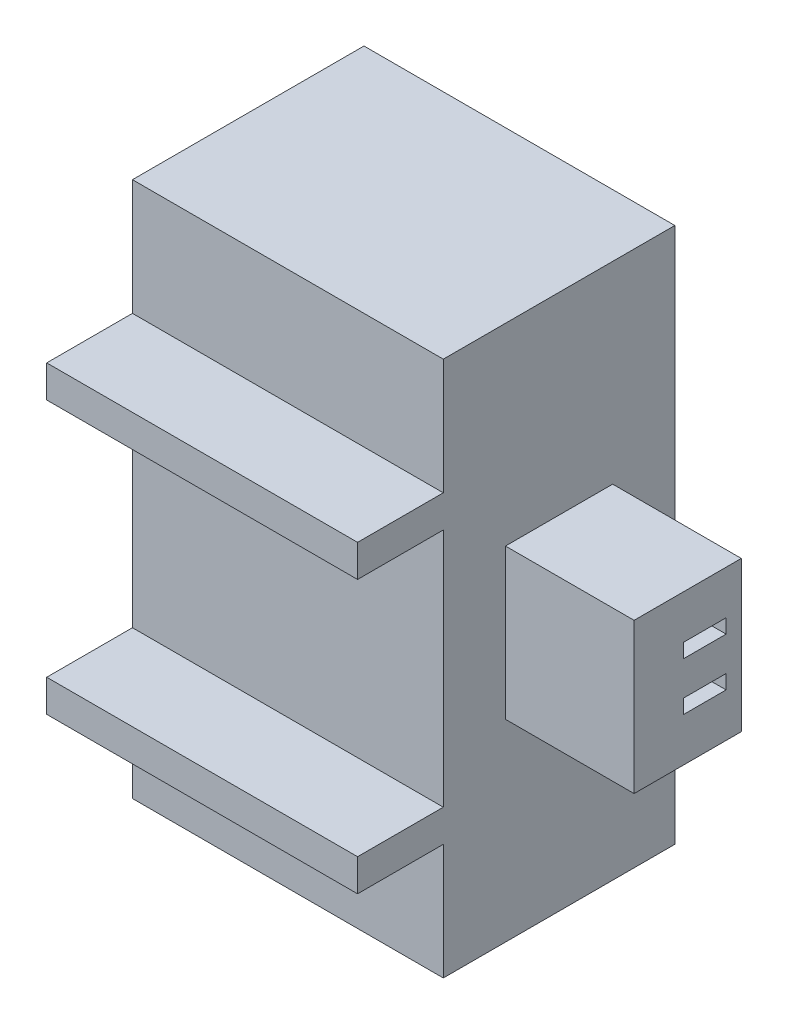
ISO-10303-21;
HEADER;
FILE_DESCRIPTION(('STEP AP214'),'2;1');
FILE_NAME('part.step','',(''),(''),'','','');
FILE_SCHEMA(('AUTOMOTIVE_DESIGN { 1 0 10303 214 1 1 1 1 }'));
ENDSEC;
DATA;
#1=APPLICATION_CONTEXT('core data for automotive mechanical design processes');
#2=APPLICATION_PROTOCOL_DEFINITION('international standard','automotive_design',2000,#1);
#3=PRODUCT_CONTEXT('',#1,'mechanical');
#4=PRODUCT('Part','Part','',(#3));
#5=PRODUCT_RELATED_PRODUCT_CATEGORY('part','',(#4));
#6=PRODUCT_DEFINITION_FORMATION('','',#4);
#7=PRODUCT_DEFINITION_CONTEXT('part definition',#1,'design');
#8=PRODUCT_DEFINITION('design','',#6,#7);
#9=PRODUCT_DEFINITION_SHAPE('','',#8);
#10=(LENGTH_UNIT() NAMED_UNIT(*) SI_UNIT(.MILLI.,.METRE.));
#11=(NAMED_UNIT(*) PLANE_ANGLE_UNIT() SI_UNIT($,.RADIAN.));
#12=(NAMED_UNIT(*) SI_UNIT($,.STERADIAN.) SOLID_ANGLE_UNIT());
#13=UNCERTAINTY_MEASURE_WITH_UNIT(LENGTH_MEASURE(1.E-05),#10,'distance_accuracy_value','');
#14=(GEOMETRIC_REPRESENTATION_CONTEXT(3) GLOBAL_UNCERTAINTY_ASSIGNED_CONTEXT((#13)) GLOBAL_UNIT_ASSIGNED_CONTEXT((#10,
#11,#12)) REPRESENTATION_CONTEXT('',''));
#15=CARTESIAN_POINT('',(0.,0.,0.));
#16=DIRECTION('',(0.,0.,1.));
#17=DIRECTION('',(1.,0.,0.));
#18=AXIS2_PLACEMENT_3D('',#15,#16,#17);
#19=CARTESIAN_POINT('',(7.25,0.,7.4));
#20=DIRECTION('',(-1.,0.,0.));
#21=DIRECTION('',(0.,0.,1.));
#22=AXIS2_PLACEMENT_3D('',#19,#20,#21);
#23=PLANE('',#22);
#24=DIRECTION('',(0.,1.,0.));
#25=VECTOR('',#24,1.);
#26=CARTESIAN_POINT('',(7.25,0.,7.4));
#27=LINE('',#26,#25);
#28=CARTESIAN_POINT('',(7.25,9.04983220465185,7.4));
#29=VERTEX_POINT('',#28);
#30=CARTESIAN_POINT('',(7.25,9.79983220465185,7.4));
#31=VERTEX_POINT('',#30);
#32=EDGE_CURVE('E361',#29,#31,#27,.T.);
#33=ORIENTED_EDGE('',*,*,#32,.F.);
#34=DIRECTION('',(0.,0.,1.));
#35=VECTOR('',#34,1.);
#36=CARTESIAN_POINT('',(7.25,9.04983220465185,7.4));
#37=LINE('',#36,#35);
#38=CARTESIAN_POINT('',(7.25,9.04983220465185,5.4));
#39=VERTEX_POINT('',#38);
#40=EDGE_CURVE('E299',#39,#29,#37,.T.);
#41=ORIENTED_EDGE('',*,*,#40,.F.);
#42=DIRECTION('',(0.,1.,0.));
#43=VECTOR('',#42,1.);
#44=CARTESIAN_POINT('',(7.25,9.04983220465185,5.4));
#45=LINE('',#44,#43);
#46=CARTESIAN_POINT('',(7.25,3.45016779534815,5.4));
#47=VERTEX_POINT('',#46);
#48=EDGE_CURVE('E308',#47,#39,#45,.T.);
#49=ORIENTED_EDGE('',*,*,#48,.F.);
#50=DIRECTION('',(0.,0.,-1.));
#51=VECTOR('',#50,1.);
#52=CARTESIAN_POINT('',(7.25,3.45016779534815,7.4));
#53=LINE('',#52,#51);
#54=CARTESIAN_POINT('',(7.25,3.45016779534815,7.4));
#55=VERTEX_POINT('',#54);
#56=EDGE_CURVE('E294',#55,#47,#53,.T.);
#57=ORIENTED_EDGE('',*,*,#56,.F.);
#58=CARTESIAN_POINT('',(7.25,2.70016779534815,7.4));
#59=VERTEX_POINT('',#58);
#60=EDGE_CURVE('E363',#59,#55,#27,.T.);
#61=ORIENTED_EDGE('',*,*,#60,.F.);
#62=DIRECTION('',(0.,0.,1.));
#63=VECTOR('',#62,1.);
#64=CARTESIAN_POINT('',(7.25,2.70016779534815,7.4));
#65=LINE('',#64,#63);
#66=CARTESIAN_POINT('',(7.25,2.70016779534815,5.4));
#67=VERTEX_POINT('',#66);
#68=EDGE_CURVE('E325',#67,#59,#65,.T.);
#69=ORIENTED_EDGE('',*,*,#68,.F.);
#70=DIRECTION('',(0.,1.,0.));
#71=VECTOR('',#70,1.);
#72=CARTESIAN_POINT('',(7.25,0.,5.4));
#73=LINE('',#72,#71);
#74=CARTESIAN_POINT('',(7.25,0.,5.4));
#75=VERTEX_POINT('',#74);
#76=EDGE_CURVE('E315',#75,#67,#73,.T.);
#77=ORIENTED_EDGE('',*,*,#76,.F.);
#78=DIRECTION('',(0.,0.,-1.));
#79=VECTOR('',#78,1.);
#80=CARTESIAN_POINT('',(7.25,0.,7.4));
#81=LINE('',#80,#79);
#82=CARTESIAN_POINT('',(7.25,0.,0.));
#83=VERTEX_POINT('',#82);
#84=EDGE_CURVE('E44',#75,#83,#81,.T.);
#85=ORIENTED_EDGE('',*,*,#84,.T.);
#86=DIRECTION('',(0.,1.,0.));
#87=VECTOR('',#86,1.);
#88=CARTESIAN_POINT('',(7.25,0.,0.));
#89=LINE('',#88,#87);
#90=CARTESIAN_POINT('',(7.25,12.5,0.));
#91=VERTEX_POINT('',#90);
#92=EDGE_CURVE('E372',#83,#91,#89,.T.);
#93=ORIENTED_EDGE('',*,*,#92,.T.);
#94=DIRECTION('',(0.,0.,-1.));
#95=VECTOR('',#94,1.);
#96=CARTESIAN_POINT('',(7.25,12.5,7.4));
#97=LINE('',#96,#95);
#98=CARTESIAN_POINT('',(7.25,12.5,5.4));
#99=VERTEX_POINT('',#98);
#100=EDGE_CURVE('E379',#99,#91,#97,.T.);
#101=ORIENTED_EDGE('',*,*,#100,.F.);
#102=DIRECTION('',(0.,1.,0.));
#103=VECTOR('',#102,1.);
#104=CARTESIAN_POINT('',(7.25,12.5,5.4));
#105=LINE('',#104,#103);
#106=CARTESIAN_POINT('',(7.25,9.79983220465185,5.4));
#107=VERTEX_POINT('',#106);
#108=EDGE_CURVE('E343',#107,#99,#105,.T.);
#109=ORIENTED_EDGE('',*,*,#108,.F.);
#110=DIRECTION('',(0.,0.,-1.));
#111=VECTOR('',#110,1.);
#112=CARTESIAN_POINT('',(7.25,9.79983220465185,7.4));
#113=LINE('',#112,#111);
#114=EDGE_CURVE('E335',#31,#107,#113,.T.);
#115=ORIENTED_EDGE('',*,*,#114,.F.);
#116=EDGE_LOOP('',(#33,#41,#49,#57,#61,#69,#77,#85,#93,#101,#109,#115));
#117=FACE_BOUND('',#116,.T.);
#118=DIRECTION('',(0.,-1.,0.));
#119=VECTOR('',#118,1.);
#120=CARTESIAN_POINT('',(7.25,8.,3.95));
#121=LINE('',#120,#119);
#122=CARTESIAN_POINT('',(7.25,8.,3.95));
#123=VERTEX_POINT('',#122);
#124=CARTESIAN_POINT('',(7.25,4.5,3.95));
#125=VERTEX_POINT('',#124);
#126=EDGE_CURVE('E266',#123,#125,#121,.T.);
#127=ORIENTED_EDGE('',*,*,#126,.F.);
#128=DIRECTION('',(0.,0.,1.));
#129=VECTOR('',#128,1.);
#130=CARTESIAN_POINT('',(7.25,8.,3.95));
#131=LINE('',#130,#129);
#132=CARTESIAN_POINT('',(7.25,8.,1.45));
#133=VERTEX_POINT('',#132);
#134=EDGE_CURVE('E271',#133,#123,#131,.T.);
#135=ORIENTED_EDGE('',*,*,#134,.F.);
#136=DIRECTION('',(0.,1.,0.));
#137=VECTOR('',#136,1.);
#138=CARTESIAN_POINT('',(7.25,8.,1.45));
#139=LINE('',#138,#137);
#140=CARTESIAN_POINT('',(7.25,4.5,1.45));
#141=VERTEX_POINT('',#140);
#142=EDGE_CURVE('E56',#141,#133,#139,.T.);
#143=ORIENTED_EDGE('',*,*,#142,.F.);
#144=DIRECTION('',(0.,0.,-1.));
#145=VECTOR('',#144,1.);
#146=CARTESIAN_POINT('',(7.25,4.5,3.95));
#147=LINE('',#146,#145);
#148=EDGE_CURVE('E51',#125,#141,#147,.T.);
#149=ORIENTED_EDGE('',*,*,#148,.F.);
#150=EDGE_LOOP('',(#127,#135,#143,#149));
#151=FACE_BOUND('',#150,.T.);
#152=ADVANCED_FACE('F36',(#117,#151),#23,.F.);
#153=CARTESIAN_POINT('',(0.,0.,7.4));
#154=DIRECTION('',(0.,0.,-1.));
#155=DIRECTION('',(-1.,0.,0.));
#156=AXIS2_PLACEMENT_3D('',#153,#154,#155);
#157=PLANE('',#156);
#158=DIRECTION('',(0.,-1.,0.));
#159=VECTOR('',#158,1.);
#160=CARTESIAN_POINT('',(0.,0.,7.4));
#161=LINE('',#160,#159);
#162=CARTESIAN_POINT('',(0.,9.79983220465185,7.4));
#163=VERTEX_POINT('',#162);
#164=CARTESIAN_POINT('',(0.,9.04983220465185,7.4));
#165=VERTEX_POINT('',#164);
#166=EDGE_CURVE('E358',#163,#165,#161,.T.);
#167=ORIENTED_EDGE('',*,*,#166,.T.);
#168=DIRECTION('',(1.,0.,0.));
#169=VECTOR('',#168,1.);
#170=CARTESIAN_POINT('',(0.,9.04983220465185,7.4));
#171=LINE('',#170,#169);
#172=EDGE_CURVE('E312',#165,#29,#171,.T.);
#173=ORIENTED_EDGE('',*,*,#172,.T.);
#174=ORIENTED_EDGE('',*,*,#32,.T.);
#175=DIRECTION('',(1.,0.,0.));
#176=VECTOR('',#175,1.);
#177=CARTESIAN_POINT('',(0.,9.79983220465185,7.4));
#178=LINE('',#177,#176);
#179=EDGE_CURVE('E346',#163,#31,#178,.T.);
#180=ORIENTED_EDGE('',*,*,#179,.F.);
#181=EDGE_LOOP('',(#167,#173,#174,#180));
#182=FACE_BOUND('',#181,.T.);
#183=ADVANCED_FACE('F409',(#182),#157,.F.);
#184=CARTESIAN_POINT('',(0.,0.,7.4));
#185=DIRECTION('',(1.,0.,0.));
#186=DIRECTION('',(0.,0.,-1.));
#187=AXIS2_PLACEMENT_3D('',#184,#185,#186);
#188=PLANE('',#187);
#189=DIRECTION('',(0.,1.,0.));
#190=VECTOR('',#189,1.);
#191=CARTESIAN_POINT('',(0.,9.04983220465185,5.4));
#192=LINE('',#191,#190);
#193=CARTESIAN_POINT('',(0.,3.45016779534815,5.4));
#194=VERTEX_POINT('',#193);
#195=CARTESIAN_POINT('',(0.,9.04983220465185,5.4));
#196=VERTEX_POINT('',#195);
#197=EDGE_CURVE('E298',#194,#196,#192,.T.);
#198=ORIENTED_EDGE('',*,*,#197,.T.);
#199=DIRECTION('',(0.,0.,1.));
#200=VECTOR('',#199,1.);
#201=CARTESIAN_POINT('',(0.,9.04983220465185,7.4));
#202=LINE('',#201,#200);
#203=EDGE_CURVE('E302',#196,#165,#202,.T.);
#204=ORIENTED_EDGE('',*,*,#203,.T.);
#205=ORIENTED_EDGE('',*,*,#166,.F.);
#206=DIRECTION('',(0.,0.,-1.));
#207=VECTOR('',#206,1.);
#208=CARTESIAN_POINT('',(0.,9.79983220465185,7.4));
#209=LINE('',#208,#207);
#210=CARTESIAN_POINT('',(0.,9.79983220465185,5.4));
#211=VERTEX_POINT('',#210);
#212=EDGE_CURVE('E339',#163,#211,#209,.T.);
#213=ORIENTED_EDGE('',*,*,#212,.T.);
#214=DIRECTION('',(0.,1.,0.));
#215=VECTOR('',#214,1.);
#216=CARTESIAN_POINT('',(0.,12.5,5.4));
#217=LINE('',#216,#215);
#218=CARTESIAN_POINT('',(0.,12.5,5.4));
#219=VERTEX_POINT('',#218);
#220=EDGE_CURVE('E342',#211,#219,#217,.T.);
#221=ORIENTED_EDGE('',*,*,#220,.T.);
#222=DIRECTION('',(0.,0.,-1.));
#223=VECTOR('',#222,1.);
#224=CARTESIAN_POINT('',(0.,12.5,7.4));
#225=LINE('',#224,#223);
#226=CARTESIAN_POINT('',(0.,12.5,0.));
#227=VERTEX_POINT('',#226);
#228=EDGE_CURVE('E366',#219,#227,#225,.T.);
#229=ORIENTED_EDGE('',*,*,#228,.T.);
#230=DIRECTION('',(0.,-1.,0.));
#231=VECTOR('',#230,1.);
#232=CARTESIAN_POINT('',(0.,0.,0.));
#233=LINE('',#232,#231);
#234=CARTESIAN_POINT('',(0.,0.,0.));
#235=VERTEX_POINT('',#234);
#236=EDGE_CURVE('E353',#227,#235,#233,.T.);
#237=ORIENTED_EDGE('',*,*,#236,.T.);
#238=DIRECTION('',(0.,0.,-1.));
#239=VECTOR('',#238,1.);
#240=CARTESIAN_POINT('',(0.,0.,7.4));
#241=LINE('',#240,#239);
#242=CARTESIAN_POINT('',(0.,0.,5.4));
#243=VERTEX_POINT('',#242);
#244=EDGE_CURVE('E11',#243,#235,#241,.T.);
#245=ORIENTED_EDGE('',*,*,#244,.F.);
#246=DIRECTION('',(0.,1.,0.));
#247=VECTOR('',#246,1.);
#248=CARTESIAN_POINT('',(0.,0.,5.4));
#249=LINE('',#248,#247);
#250=CARTESIAN_POINT('',(0.,2.70016779534815,5.4));
#251=VERTEX_POINT('',#250);
#252=EDGE_CURVE('E321',#243,#251,#249,.T.);
#253=ORIENTED_EDGE('',*,*,#252,.T.);
#254=DIRECTION('',(0.,0.,1.));
#255=VECTOR('',#254,1.);
#256=CARTESIAN_POINT('',(0.,2.70016779534815,7.4));
#257=LINE('',#256,#255);
#258=CARTESIAN_POINT('',(0.,2.70016779534815,7.4));
#259=VERTEX_POINT('',#258);
#260=EDGE_CURVE('E324',#251,#259,#257,.T.);
#261=ORIENTED_EDGE('',*,*,#260,.T.);
#262=CARTESIAN_POINT('',(0.,3.45016779534815,7.4));
#263=VERTEX_POINT('',#262);
#264=EDGE_CURVE('E362',#263,#259,#161,.T.);
#265=ORIENTED_EDGE('',*,*,#264,.F.);
#266=DIRECTION('',(0.,0.,-1.));
#267=VECTOR('',#266,1.);
#268=CARTESIAN_POINT('',(0.,3.45016779534815,7.4));
#269=LINE('',#268,#267);
#270=EDGE_CURVE('E295',#263,#194,#269,.T.);
#271=ORIENTED_EDGE('',*,*,#270,.T.);
#272=EDGE_LOOP('',(#198,#204,#205,#213,#221,#229,#237,#245,#253,#261,#265,#271));
#273=FACE_BOUND('',#272,.T.);
#274=ADVANCED_FACE('F38',(#273),#188,.F.);
#275=CARTESIAN_POINT('',(0.,0.,7.4));
#276=DIRECTION('',(0.,1.,0.));
#277=DIRECTION('',(0.,0.,1.));
#278=AXIS2_PLACEMENT_3D('',#275,#276,#277);
#279=PLANE('',#278);
#280=ORIENTED_EDGE('',*,*,#84,.F.);
#281=DIRECTION('',(1.,0.,0.));
#282=VECTOR('',#281,1.);
#283=CARTESIAN_POINT('',(0.,0.,5.4));
#284=LINE('',#283,#282);
#285=EDGE_CURVE('E328',#243,#75,#284,.T.);
#286=ORIENTED_EDGE('',*,*,#285,.F.);
#287=ORIENTED_EDGE('',*,*,#244,.T.);
#288=DIRECTION('',(1.,0.,0.));
#289=VECTOR('',#288,1.);
#290=CARTESIAN_POINT('',(0.,0.,0.));
#291=LINE('',#290,#289);
#292=EDGE_CURVE('E369',#235,#83,#291,.T.);
#293=ORIENTED_EDGE('',*,*,#292,.T.);
#294=EDGE_LOOP('',(#280,#286,#287,#293));
#295=FACE_BOUND('',#294,.T.);
#296=ADVANCED_FACE('F391',(#295),#279,.F.);
#297=CARTESIAN_POINT('',(0.,12.5,7.4));
#298=DIRECTION('',(0.,-1.,0.));
#299=DIRECTION('',(0.,0.,-1.));
#300=AXIS2_PLACEMENT_3D('',#297,#298,#299);
#301=PLANE('',#300);
#302=ORIENTED_EDGE('',*,*,#228,.F.);
#303=DIRECTION('',(1.,0.,0.));
#304=VECTOR('',#303,1.);
#305=CARTESIAN_POINT('',(0.,12.5,5.4));
#306=LINE('',#305,#304);
#307=EDGE_CURVE('E350',#219,#99,#306,.T.);
#308=ORIENTED_EDGE('',*,*,#307,.T.);
#309=ORIENTED_EDGE('',*,*,#100,.T.);
#310=DIRECTION('',(-1.,0.,0.));
#311=VECTOR('',#310,1.);
#312=CARTESIAN_POINT('',(0.,12.5,0.));
#313=LINE('',#312,#311);
#314=EDGE_CURVE('E375',#91,#227,#313,.T.);
#315=ORIENTED_EDGE('',*,*,#314,.T.);
#316=EDGE_LOOP('',(#302,#308,#309,#315));
#317=FACE_BOUND('',#316,.T.);
#318=ADVANCED_FACE('F398',(#317),#301,.F.);
#319=ORIENTED_EDGE('',*,*,#60,.T.);
#320=DIRECTION('',(1.,0.,0.));
#321=VECTOR('',#320,1.);
#322=CARTESIAN_POINT('',(0.,3.45016779534815,7.4));
#323=LINE('',#322,#321);
#324=EDGE_CURVE('E305',#263,#55,#323,.T.);
#325=ORIENTED_EDGE('',*,*,#324,.F.);
#326=ORIENTED_EDGE('',*,*,#264,.T.);
#327=DIRECTION('',(1.,0.,0.));
#328=VECTOR('',#327,1.);
#329=CARTESIAN_POINT('',(0.,2.70016779534815,7.4));
#330=LINE('',#329,#328);
#331=EDGE_CURVE('E332',#259,#59,#330,.T.);
#332=ORIENTED_EDGE('',*,*,#331,.T.);
#333=EDGE_LOOP('',(#319,#325,#326,#332));
#334=FACE_BOUND('',#333,.T.);
#335=ADVANCED_FACE('F426',(#334),#157,.F.);
#336=CARTESIAN_POINT('',(0.,0.,0.));
#337=DIRECTION('',(0.,0.,-1.));
#338=DIRECTION('',(-1.,0.,0.));
#339=AXIS2_PLACEMENT_3D('',#336,#337,#338);
#340=PLANE('',#339);
#341=ORIENTED_EDGE('',*,*,#236,.F.);
#342=ORIENTED_EDGE('',*,*,#314,.F.);
#343=ORIENTED_EDGE('',*,*,#92,.F.);
#344=ORIENTED_EDGE('',*,*,#292,.F.);
#345=EDGE_LOOP('',(#341,#342,#343,#344));
#346=FACE_BOUND('',#345,.T.);
#347=ADVANCED_FACE('F395',(#346),#340,.T.);
#348=CARTESIAN_POINT('',(0.,12.5,5.4));
#349=DIRECTION('',(0.,0.,-1.));
#350=DIRECTION('',(-1.,0.,0.));
#351=AXIS2_PLACEMENT_3D('',#348,#349,#350);
#352=PLANE('',#351);
#353=ORIENTED_EDGE('',*,*,#108,.T.);
#354=ORIENTED_EDGE('',*,*,#307,.F.);
#355=ORIENTED_EDGE('',*,*,#220,.F.);
#356=DIRECTION('',(1.,0.,0.));
#357=VECTOR('',#356,1.);
#358=CARTESIAN_POINT('',(0.,9.79983220465185,5.4));
#359=LINE('',#358,#357);
#360=EDGE_CURVE('E354',#211,#107,#359,.T.);
#361=ORIENTED_EDGE('',*,*,#360,.T.);
#362=EDGE_LOOP('',(#353,#354,#355,#361));
#363=FACE_BOUND('',#362,.T.);
#364=ADVANCED_FACE('F402',(#363),#352,.F.);
#365=CARTESIAN_POINT('',(0.,9.79983220465185,7.4));
#366=DIRECTION('',(0.,-1.,0.));
#367=DIRECTION('',(0.,0.,-1.));
#368=AXIS2_PLACEMENT_3D('',#365,#366,#367);
#369=PLANE('',#368);
#370=ORIENTED_EDGE('',*,*,#114,.T.);
#371=ORIENTED_EDGE('',*,*,#360,.F.);
#372=ORIENTED_EDGE('',*,*,#212,.F.);
#373=ORIENTED_EDGE('',*,*,#179,.T.);
#374=EDGE_LOOP('',(#370,#371,#372,#373));
#375=FACE_BOUND('',#374,.T.);
#376=ADVANCED_FACE('F405',(#375),#369,.F.);
#377=CARTESIAN_POINT('',(0.,2.70016779534815,7.4));
#378=DIRECTION('',(0.,1.,0.));
#379=DIRECTION('',(0.,0.,1.));
#380=AXIS2_PLACEMENT_3D('',#377,#378,#379);
#381=PLANE('',#380);
#382=ORIENTED_EDGE('',*,*,#68,.T.);
#383=ORIENTED_EDGE('',*,*,#331,.F.);
#384=ORIENTED_EDGE('',*,*,#260,.F.);
#385=DIRECTION('',(1.,0.,0.));
#386=VECTOR('',#385,1.);
#387=CARTESIAN_POINT('',(0.,2.70016779534815,5.4));
#388=LINE('',#387,#386);
#389=EDGE_CURVE('E336',#251,#67,#388,.T.);
#390=ORIENTED_EDGE('',*,*,#389,.T.);
#391=EDGE_LOOP('',(#382,#383,#384,#390));
#392=FACE_BOUND('',#391,.T.);
#393=ADVANCED_FACE('F430',(#392),#381,.F.);
#394=CARTESIAN_POINT('',(0.,0.,5.4));
#395=DIRECTION('',(0.,0.,-1.));
#396=DIRECTION('',(-1.,0.,0.));
#397=AXIS2_PLACEMENT_3D('',#394,#395,#396);
#398=PLANE('',#397);
#399=ORIENTED_EDGE('',*,*,#76,.T.);
#400=ORIENTED_EDGE('',*,*,#389,.F.);
#401=ORIENTED_EDGE('',*,*,#252,.F.);
#402=ORIENTED_EDGE('',*,*,#285,.T.);
#403=EDGE_LOOP('',(#399,#400,#401,#402));
#404=FACE_BOUND('',#403,.T.);
#405=ADVANCED_FACE('F432',(#404),#398,.F.);
#406=CARTESIAN_POINT('',(0.,9.04983220465185,7.4));
#407=DIRECTION('',(0.,1.,0.));
#408=DIRECTION('',(0.,0.,1.));
#409=AXIS2_PLACEMENT_3D('',#406,#407,#408);
#410=PLANE('',#409);
#411=ORIENTED_EDGE('',*,*,#40,.T.);
#412=ORIENTED_EDGE('',*,*,#172,.F.);
#413=ORIENTED_EDGE('',*,*,#203,.F.);
#414=DIRECTION('',(1.,0.,0.));
#415=VECTOR('',#414,1.);
#416=CARTESIAN_POINT('',(0.,9.04983220465185,5.4));
#417=LINE('',#416,#415);
#418=EDGE_CURVE('E316',#196,#39,#417,.T.);
#419=ORIENTED_EDGE('',*,*,#418,.T.);
#420=EDGE_LOOP('',(#411,#412,#413,#419));
#421=FACE_BOUND('',#420,.T.);
#422=ADVANCED_FACE('F414',(#421),#410,.F.);
#423=CARTESIAN_POINT('',(0.,9.04983220465185,5.4));
#424=DIRECTION('',(0.,0.,-1.));
#425=DIRECTION('',(-1.,0.,0.));
#426=AXIS2_PLACEMENT_3D('',#423,#424,#425);
#427=PLANE('',#426);
#428=ORIENTED_EDGE('',*,*,#48,.T.);
#429=ORIENTED_EDGE('',*,*,#418,.F.);
#430=ORIENTED_EDGE('',*,*,#197,.F.);
#431=DIRECTION('',(1.,0.,0.));
#432=VECTOR('',#431,1.);
#433=CARTESIAN_POINT('',(0.,3.45016779534815,5.4));
#434=LINE('',#433,#432);
#435=EDGE_CURVE('E318',#194,#47,#434,.T.);
#436=ORIENTED_EDGE('',*,*,#435,.T.);
#437=EDGE_LOOP('',(#428,#429,#430,#436));
#438=FACE_BOUND('',#437,.T.);
#439=ADVANCED_FACE('F420',(#438),#427,.F.);
#440=CARTESIAN_POINT('',(0.,3.45016779534815,7.4));
#441=DIRECTION('',(0.,-1.,0.));
#442=DIRECTION('',(0.,0.,-1.));
#443=AXIS2_PLACEMENT_3D('',#440,#441,#442);
#444=PLANE('',#443);
#445=ORIENTED_EDGE('',*,*,#56,.T.);
#446=ORIENTED_EDGE('',*,*,#435,.F.);
#447=ORIENTED_EDGE('',*,*,#270,.F.);
#448=ORIENTED_EDGE('',*,*,#324,.T.);
#449=EDGE_LOOP('',(#445,#446,#447,#448));
#450=FACE_BOUND('',#449,.T.);
#451=ADVANCED_FACE('F422',(#450),#444,.F.);
#452=CARTESIAN_POINT('',(10.25,0.,0.));
#453=DIRECTION('',(1.,0.,0.));
#454=DIRECTION('',(0.,0.,-1.));
#455=AXIS2_PLACEMENT_3D('',#452,#453,#454);
#456=PLANE('',#455);
#457=DIRECTION('',(0.,0.,-1.));
#458=VECTOR('',#457,1.);
#459=CARTESIAN_POINT('',(10.25,6.64774485482273,2.80366487818985));
#460=LINE('',#459,#458);
#461=CARTESIAN_POINT('',(10.25,6.64774485482273,2.80366487818985));
#462=VERTEX_POINT('',#461);
#463=CARTESIAN_POINT('',(10.25,6.64774485482273,1.80366487818985));
#464=VERTEX_POINT('',#463);
#465=EDGE_CURVE('E239',#462,#464,#460,.T.);
#466=ORIENTED_EDGE('',*,*,#465,.F.);
#467=DIRECTION('',(0.,-1.,0.));
#468=VECTOR('',#467,1.);
#469=CARTESIAN_POINT('',(10.25,6.97909511054018,2.80366487818985));
#470=LINE('',#469,#468);
#471=CARTESIAN_POINT('',(10.25,6.97909511054018,2.80366487818985));
#472=VERTEX_POINT('',#471);
#473=EDGE_CURVE('E237',#472,#462,#470,.T.);
#474=ORIENTED_EDGE('',*,*,#473,.F.);
#475=DIRECTION('',(0.,0.,1.));
#476=VECTOR('',#475,1.);
#477=CARTESIAN_POINT('',(10.25,6.97909511054018,2.80366487818985));
#478=LINE('',#477,#476);
#479=CARTESIAN_POINT('',(10.25,6.97909511054018,1.80366487818985));
#480=VERTEX_POINT('',#479);
#481=EDGE_CURVE('E245',#480,#472,#478,.T.);
#482=ORIENTED_EDGE('',*,*,#481,.F.);
#483=DIRECTION('',(0.,1.,0.));
#484=VECTOR('',#483,1.);
#485=CARTESIAN_POINT('',(10.25,6.97909511054018,1.80366487818985));
#486=LINE('',#485,#484);
#487=EDGE_CURVE('E242',#464,#480,#486,.T.);
#488=ORIENTED_EDGE('',*,*,#487,.F.);
#489=EDGE_LOOP('',(#466,#474,#482,#488));
#490=FACE_BOUND('',#489,.T.);
#491=DIRECTION('',(0.,-1.,0.));
#492=VECTOR('',#491,1.);
#493=CARTESIAN_POINT('',(10.25,8.,3.95));
#494=LINE('',#493,#492);
#495=CARTESIAN_POINT('',(10.25,8.,3.95));
#496=VERTEX_POINT('',#495);
#497=CARTESIAN_POINT('',(10.25,4.5,3.95));
#498=VERTEX_POINT('',#497);
#499=EDGE_CURVE('E267',#496,#498,#494,.T.);
#500=ORIENTED_EDGE('',*,*,#499,.T.);
#501=DIRECTION('',(0.,0.,-1.));
#502=VECTOR('',#501,1.);
#503=CARTESIAN_POINT('',(10.25,4.5,3.95));
#504=LINE('',#503,#502);
#505=CARTESIAN_POINT('',(10.25,4.5,1.45));
#506=VERTEX_POINT('',#505);
#507=EDGE_CURVE('E270',#498,#506,#504,.T.);
#508=ORIENTED_EDGE('',*,*,#507,.T.);
#509=DIRECTION('',(0.,1.,0.));
#510=VECTOR('',#509,1.);
#511=CARTESIAN_POINT('',(10.25,8.,1.45));
#512=LINE('',#511,#510);
#513=CARTESIAN_POINT('',(10.25,8.,1.45));
#514=VERTEX_POINT('',#513);
#515=EDGE_CURVE('E273',#506,#514,#512,.T.);
#516=ORIENTED_EDGE('',*,*,#515,.T.);
#517=DIRECTION('',(0.,0.,1.));
#518=VECTOR('',#517,1.);
#519=CARTESIAN_POINT('',(10.25,8.,3.95));
#520=LINE('',#519,#518);
#521=EDGE_CURVE('E275',#514,#496,#520,.T.);
#522=ORIENTED_EDGE('',*,*,#521,.T.);
#523=EDGE_LOOP('',(#500,#508,#516,#522));
#524=FACE_BOUND('',#523,.T.);
#525=DIRECTION('',(0.,1.,0.));
#526=VECTOR('',#525,1.);
#527=CARTESIAN_POINT('',(10.25,5.52090488945982,1.80366487818985));
#528=LINE('',#527,#526);
#529=CARTESIAN_POINT('',(10.25,5.52090488945982,1.80366487818985));
#530=VERTEX_POINT('',#529);
#531=CARTESIAN_POINT('',(10.25,5.85225514517727,1.80366487818985));
#532=VERTEX_POINT('',#531);
#533=EDGE_CURVE('E205',#530,#532,#528,.T.);
#534=ORIENTED_EDGE('',*,*,#533,.F.);
#535=DIRECTION('',(0.,0.,-1.));
#536=VECTOR('',#535,1.);
#537=CARTESIAN_POINT('',(10.25,5.52090488945982,2.80366487818985));
#538=LINE('',#537,#536);
#539=CARTESIAN_POINT('',(10.25,5.52090488945982,2.80366487818985));
#540=VERTEX_POINT('',#539);
#541=EDGE_CURVE('E195',#540,#530,#538,.T.);
#542=ORIENTED_EDGE('',*,*,#541,.F.);
#543=DIRECTION('',(0.,-1.,0.));
#544=VECTOR('',#543,1.);
#545=CARTESIAN_POINT('',(10.25,5.52090488945982,2.80366487818985));
#546=LINE('',#545,#544);
#547=CARTESIAN_POINT('',(10.25,5.85225514517727,2.80366487818985));
#548=VERTEX_POINT('',#547);
#549=EDGE_CURVE('E221',#548,#540,#546,.T.);
#550=ORIENTED_EDGE('',*,*,#549,.F.);
#551=DIRECTION('',(0.,0.,1.));
#552=VECTOR('',#551,1.);
#553=CARTESIAN_POINT('',(10.25,5.85225514517727,2.80366487818985));
#554=LINE('',#553,#552);
#555=EDGE_CURVE('E219',#532,#548,#554,.T.);
#556=ORIENTED_EDGE('',*,*,#555,.F.);
#557=EDGE_LOOP('',(#534,#542,#550,#556));
#558=FACE_BOUND('',#557,.T.);
#559=ADVANCED_FACE('F217',(#490,#524,#558),#456,.T.);
#560=CARTESIAN_POINT('',(10.25,8.,3.95));
#561=DIRECTION('',(0.,0.,-1.));
#562=DIRECTION('',(-1.,0.,0.));
#563=AXIS2_PLACEMENT_3D('',#560,#561,#562);
#564=PLANE('',#563);
#565=ORIENTED_EDGE('',*,*,#126,.T.);
#566=DIRECTION('',(-1.,0.,0.));
#567=VECTOR('',#566,1.);
#568=CARTESIAN_POINT('',(10.25,4.5,3.95));
#569=LINE('',#568,#567);
#570=EDGE_CURVE('E292',#498,#125,#569,.T.);
#571=ORIENTED_EDGE('',*,*,#570,.F.);
#572=ORIENTED_EDGE('',*,*,#499,.F.);
#573=DIRECTION('',(-1.,0.,0.));
#574=VECTOR('',#573,1.);
#575=CARTESIAN_POINT('',(10.25,8.,3.95));
#576=LINE('',#575,#574);
#577=EDGE_CURVE('E277',#496,#123,#576,.T.);
#578=ORIENTED_EDGE('',*,*,#577,.T.);
#579=EDGE_LOOP('',(#565,#571,#572,#578));
#580=FACE_BOUND('',#579,.T.);
#581=ADVANCED_FACE('F493',(#580),#564,.F.);
#582=CARTESIAN_POINT('',(10.25,4.5,3.95));
#583=DIRECTION('',(0.,1.,0.));
#584=DIRECTION('',(0.,0.,1.));
#585=AXIS2_PLACEMENT_3D('',#582,#583,#584);
#586=PLANE('',#585);
#587=ORIENTED_EDGE('',*,*,#148,.T.);
#588=DIRECTION('',(-1.,0.,0.));
#589=VECTOR('',#588,1.);
#590=CARTESIAN_POINT('',(10.25,4.5,1.45));
#591=LINE('',#590,#589);
#592=EDGE_CURVE('E289',#506,#141,#591,.T.);
#593=ORIENTED_EDGE('',*,*,#592,.F.);
#594=ORIENTED_EDGE('',*,*,#507,.F.);
#595=ORIENTED_EDGE('',*,*,#570,.T.);
#596=EDGE_LOOP('',(#587,#593,#594,#595));
#597=FACE_BOUND('',#596,.T.);
#598=ADVANCED_FACE('F501',(#597),#586,.F.);
#599=CARTESIAN_POINT('',(10.25,8.,1.45));
#600=DIRECTION('',(0.,0.,1.));
#601=DIRECTION('',(1.,0.,0.));
#602=AXIS2_PLACEMENT_3D('',#599,#600,#601);
#603=PLANE('',#602);
#604=ORIENTED_EDGE('',*,*,#142,.T.);
#605=DIRECTION('',(-1.,0.,0.));
#606=VECTOR('',#605,1.);
#607=CARTESIAN_POINT('',(10.25,8.,1.45));
#608=LINE('',#607,#606);
#609=EDGE_CURVE('E286',#514,#133,#608,.T.);
#610=ORIENTED_EDGE('',*,*,#609,.F.);
#611=ORIENTED_EDGE('',*,*,#515,.F.);
#612=ORIENTED_EDGE('',*,*,#592,.T.);
#613=EDGE_LOOP('',(#604,#610,#611,#612));
#614=FACE_BOUND('',#613,.T.);
#615=ADVANCED_FACE('F497',(#614),#603,.F.);
#616=CARTESIAN_POINT('',(10.25,8.,3.95));
#617=DIRECTION('',(0.,-1.,0.));
#618=DIRECTION('',(0.,0.,-1.));
#619=AXIS2_PLACEMENT_3D('',#616,#617,#618);
#620=PLANE('',#619);
#621=ORIENTED_EDGE('',*,*,#134,.T.);
#622=ORIENTED_EDGE('',*,*,#577,.F.);
#623=ORIENTED_EDGE('',*,*,#521,.F.);
#624=ORIENTED_EDGE('',*,*,#609,.T.);
#625=EDGE_LOOP('',(#621,#622,#623,#624));
#626=FACE_BOUND('',#625,.T.);
#627=ADVANCED_FACE('F489',(#626),#620,.F.);
#628=CARTESIAN_POINT('',(10.25,6.97909511054018,2.80366487818985));
#629=DIRECTION('',(0.,0.,-1.));
#630=DIRECTION('',(-1.,0.,0.));
#631=AXIS2_PLACEMENT_3D('',#628,#629,#630);
#632=PLANE('',#631);
#633=DIRECTION('',(0.,-1.,0.));
#634=VECTOR('',#633,1.);
#635=CARTESIAN_POINT('',(7.25,6.97909511054018,2.80366487818985));
#636=LINE('',#635,#634);
#637=CARTESIAN_POINT('',(7.25,6.97909511054018,2.80366487818985));
#638=VERTEX_POINT('',#637);
#639=CARTESIAN_POINT('',(7.25,6.64774485482273,2.80366487818985));
#640=VERTEX_POINT('',#639);
#641=EDGE_CURVE('E213',#638,#640,#636,.T.);
#642=ORIENTED_EDGE('',*,*,#641,.F.);
#643=DIRECTION('',(-1.,0.,0.));
#644=VECTOR('',#643,1.);
#645=CARTESIAN_POINT('',(10.25,6.97909511054018,2.80366487818985));
#646=LINE('',#645,#644);
#647=EDGE_CURVE('E247',#472,#638,#646,.T.);
#648=ORIENTED_EDGE('',*,*,#647,.F.);
#649=ORIENTED_EDGE('',*,*,#473,.T.);
#650=DIRECTION('',(-1.,0.,0.));
#651=VECTOR('',#650,1.);
#652=CARTESIAN_POINT('',(10.25,6.64774485482273,2.80366487818985));
#653=LINE('',#652,#651);
#654=EDGE_CURVE('E263',#462,#640,#653,.T.);
#655=ORIENTED_EDGE('',*,*,#654,.T.);
#656=EDGE_LOOP('',(#642,#648,#649,#655));
#657=FACE_BOUND('',#656,.T.);
#658=ADVANCED_FACE('F485',(#657),#632,.T.);
#659=CARTESIAN_POINT('',(10.25,6.64774485482273,2.80366487818985));
#660=DIRECTION('',(0.,1.,0.));
#661=DIRECTION('',(0.,0.,1.));
#662=AXIS2_PLACEMENT_3D('',#659,#660,#661);
#663=PLANE('',#662);
#664=DIRECTION('',(0.,0.,-1.));
#665=VECTOR('',#664,1.);
#666=CARTESIAN_POINT('',(7.25,6.64774485482273,2.80366487818985));
#667=LINE('',#666,#665);
#668=CARTESIAN_POINT('',(7.25,6.64774485482273,1.80366487818985));
#669=VERTEX_POINT('',#668);
#670=EDGE_CURVE('E250',#640,#669,#667,.T.);
#671=ORIENTED_EDGE('',*,*,#670,.F.);
#672=ORIENTED_EDGE('',*,*,#654,.F.);
#673=ORIENTED_EDGE('',*,*,#465,.T.);
#674=DIRECTION('',(-1.,0.,0.));
#675=VECTOR('',#674,1.);
#676=CARTESIAN_POINT('',(10.25,6.64774485482273,1.80366487818985));
#677=LINE('',#676,#675);
#678=EDGE_CURVE('E261',#464,#669,#677,.T.);
#679=ORIENTED_EDGE('',*,*,#678,.T.);
#680=EDGE_LOOP('',(#671,#672,#673,#679));
#681=FACE_BOUND('',#680,.T.);
#682=ADVANCED_FACE('F481',(#681),#663,.T.);
#683=CARTESIAN_POINT('',(10.25,6.97909511054018,1.80366487818985));
#684=DIRECTION('',(0.,0.,1.));
#685=DIRECTION('',(1.,0.,0.));
#686=AXIS2_PLACEMENT_3D('',#683,#684,#685);
#687=PLANE('',#686);
#688=DIRECTION('',(0.,1.,0.));
#689=VECTOR('',#688,1.);
#690=CARTESIAN_POINT('',(7.25,6.97909511054018,1.80366487818985));
#691=LINE('',#690,#689);
#692=CARTESIAN_POINT('',(7.25,6.97909511054018,1.80366487818985));
#693=VERTEX_POINT('',#692);
#694=EDGE_CURVE('E253',#669,#693,#691,.T.);
#695=ORIENTED_EDGE('',*,*,#694,.F.);
#696=ORIENTED_EDGE('',*,*,#678,.F.);
#697=ORIENTED_EDGE('',*,*,#487,.T.);
#698=DIRECTION('',(-1.,0.,0.));
#699=VECTOR('',#698,1.);
#700=CARTESIAN_POINT('',(10.25,6.97909511054018,1.80366487818985));
#701=LINE('',#700,#699);
#702=EDGE_CURVE('E259',#480,#693,#701,.T.);
#703=ORIENTED_EDGE('',*,*,#702,.T.);
#704=EDGE_LOOP('',(#695,#696,#697,#703));
#705=FACE_BOUND('',#704,.T.);
#706=ADVANCED_FACE('F477',(#705),#687,.T.);
#707=CARTESIAN_POINT('',(10.25,6.97909511054018,2.80366487818985));
#708=DIRECTION('',(0.,-1.,0.));
#709=DIRECTION('',(0.,0.,-1.));
#710=AXIS2_PLACEMENT_3D('',#707,#708,#709);
#711=PLANE('',#710);
#712=DIRECTION('',(0.,0.,1.));
#713=VECTOR('',#712,1.);
#714=CARTESIAN_POINT('',(7.25,6.97909511054018,2.80366487818985));
#715=LINE('',#714,#713);
#716=EDGE_CURVE('E240',#693,#638,#715,.T.);
#717=ORIENTED_EDGE('',*,*,#716,.F.);
#718=ORIENTED_EDGE('',*,*,#702,.F.);
#719=ORIENTED_EDGE('',*,*,#481,.T.);
#720=ORIENTED_EDGE('',*,*,#647,.T.);
#721=EDGE_LOOP('',(#717,#718,#719,#720));
#722=FACE_BOUND('',#721,.T.);
#723=ADVANCED_FACE('F474',(#722),#711,.T.);
#724=CARTESIAN_POINT('',(10.25,5.52090488945982,2.80366487818985));
#725=DIRECTION('',(0.,1.,0.));
#726=DIRECTION('',(0.,0.,1.));
#727=AXIS2_PLACEMENT_3D('',#724,#725,#726);
#728=PLANE('',#727);
#729=DIRECTION('',(0.,0.,-1.));
#730=VECTOR('',#729,1.);
#731=CARTESIAN_POINT('',(7.25,5.52090488945982,2.80366487818985));
#732=LINE('',#731,#730);
#733=CARTESIAN_POINT('',(7.25,5.52090488945982,2.80366487818985));
#734=VERTEX_POINT('',#733);
#735=CARTESIAN_POINT('',(7.25,5.52090488945982,1.80366487818985));
#736=VERTEX_POINT('',#735);
#737=EDGE_CURVE('E225',#734,#736,#732,.T.);
#738=ORIENTED_EDGE('',*,*,#737,.F.);
#739=DIRECTION('',(-1.,0.,0.));
#740=VECTOR('',#739,1.);
#741=CARTESIAN_POINT('',(10.25,5.52090488945982,2.80366487818985));
#742=LINE('',#741,#740);
#743=EDGE_CURVE('E201',#540,#734,#742,.T.);
#744=ORIENTED_EDGE('',*,*,#743,.F.);
#745=ORIENTED_EDGE('',*,*,#541,.T.);
#746=DIRECTION('',(-1.,0.,0.));
#747=VECTOR('',#746,1.);
#748=CARTESIAN_POINT('',(10.25,5.52090488945982,1.80366487818985));
#749=LINE('',#748,#747);
#750=EDGE_CURVE('E199',#530,#736,#749,.T.);
#751=ORIENTED_EDGE('',*,*,#750,.T.);
#752=EDGE_LOOP('',(#738,#744,#745,#751));
#753=FACE_BOUND('',#752,.T.);
#754=ADVANCED_FACE('F198',(#753),#728,.T.);
#755=CARTESIAN_POINT('',(10.25,5.52090488945982,1.80366487818985));
#756=DIRECTION('',(0.,0.,1.));
#757=DIRECTION('',(1.,0.,0.));
#758=AXIS2_PLACEMENT_3D('',#755,#756,#757);
#759=PLANE('',#758);
#760=DIRECTION('',(0.,1.,0.));
#761=VECTOR('',#760,1.);
#762=CARTESIAN_POINT('',(7.25,5.52090488945982,1.80366487818985));
#763=LINE('',#762,#761);
#764=CARTESIAN_POINT('',(7.25,5.85225514517727,1.80366487818985));
#765=VERTEX_POINT('',#764);
#766=EDGE_CURVE('E212',#736,#765,#763,.T.);
#767=ORIENTED_EDGE('',*,*,#766,.F.);
#768=ORIENTED_EDGE('',*,*,#750,.F.);
#769=ORIENTED_EDGE('',*,*,#533,.T.);
#770=DIRECTION('',(-1.,0.,0.));
#771=VECTOR('',#770,1.);
#772=CARTESIAN_POINT('',(10.25,5.85225514517727,1.80366487818985));
#773=LINE('',#772,#771);
#774=EDGE_CURVE('E214',#532,#765,#773,.T.);
#775=ORIENTED_EDGE('',*,*,#774,.T.);
#776=EDGE_LOOP('',(#767,#768,#769,#775));
#777=FACE_BOUND('',#776,.T.);
#778=ADVANCED_FACE('F209',(#777),#759,.T.);
#779=CARTESIAN_POINT('',(10.25,5.85225514517727,2.80366487818985));
#780=DIRECTION('',(0.,-1.,0.));
#781=DIRECTION('',(0.,0.,-1.));
#782=AXIS2_PLACEMENT_3D('',#779,#780,#781);
#783=PLANE('',#782);
#784=DIRECTION('',(0.,0.,1.));
#785=VECTOR('',#784,1.);
#786=CARTESIAN_POINT('',(7.25,5.85225514517727,2.80366487818985));
#787=LINE('',#786,#785);
#788=CARTESIAN_POINT('',(7.25,5.85225514517727,2.80366487818985));
#789=VERTEX_POINT('',#788);
#790=EDGE_CURVE('E228',#765,#789,#787,.T.);
#791=ORIENTED_EDGE('',*,*,#790,.F.);
#792=ORIENTED_EDGE('',*,*,#774,.F.);
#793=ORIENTED_EDGE('',*,*,#555,.T.);
#794=DIRECTION('',(-1.,0.,0.));
#795=VECTOR('',#794,1.);
#796=CARTESIAN_POINT('',(10.25,5.85225514517727,2.80366487818985));
#797=LINE('',#796,#795);
#798=EDGE_CURVE('E234',#548,#789,#797,.T.);
#799=ORIENTED_EDGE('',*,*,#798,.T.);
#800=EDGE_LOOP('',(#791,#792,#793,#799));
#801=FACE_BOUND('',#800,.T.);
#802=ADVANCED_FACE('F462',(#801),#783,.T.);
#803=CARTESIAN_POINT('',(10.25,5.52090488945982,2.80366487818985));
#804=DIRECTION('',(0.,0.,-1.));
#805=DIRECTION('',(-1.,0.,0.));
#806=AXIS2_PLACEMENT_3D('',#803,#804,#805);
#807=PLANE('',#806);
#808=DIRECTION('',(0.,-1.,0.));
#809=VECTOR('',#808,1.);
#810=CARTESIAN_POINT('',(7.25,5.52090488945982,2.80366487818985));
#811=LINE('',#810,#809);
#812=EDGE_CURVE('E206',#789,#734,#811,.T.);
#813=ORIENTED_EDGE('',*,*,#812,.F.);
#814=ORIENTED_EDGE('',*,*,#798,.F.);
#815=ORIENTED_EDGE('',*,*,#549,.T.);
#816=ORIENTED_EDGE('',*,*,#743,.T.);
#817=EDGE_LOOP('',(#813,#814,#815,#816));
#818=FACE_BOUND('',#817,.T.);
#819=ADVANCED_FACE('F452',(#818),#807,.T.);
#820=ORIENTED_EDGE('',*,*,#716,.T.);
#821=ORIENTED_EDGE('',*,*,#641,.T.);
#822=ORIENTED_EDGE('',*,*,#670,.T.);
#823=ORIENTED_EDGE('',*,*,#694,.T.);
#824=EDGE_LOOP('',(#820,#821,#822,#823));
#825=FACE_BOUND('',#824,.T.);
#826=ADVANCED_FACE('F444',(#825),#23,.F.);
#827=ORIENTED_EDGE('',*,*,#812,.T.);
#828=ORIENTED_EDGE('',*,*,#737,.T.);
#829=ORIENTED_EDGE('',*,*,#766,.T.);
#830=ORIENTED_EDGE('',*,*,#790,.T.);
#831=EDGE_LOOP('',(#827,#828,#829,#830));
#832=FACE_BOUND('',#831,.T.);
#833=ADVANCED_FACE('F445',(#832),#23,.F.);
#834=CLOSED_SHELL('',(#152,#183,#274,#296,#318,#335,#347,#364,#376,#393,#405,#422,#439,#451,
#559,#581,#598,#615,#627,#658,#682,#706,#723,#754,#778,#802,#819,#826,#833));
#835=MANIFOLD_SOLID_BREP('B2',#834);
#836=ADVANCED_BREP_SHAPE_REPRESENTATION('',(#18,#835),#14);
#837=SHAPE_DEFINITION_REPRESENTATION(#9,#836);
ENDSEC;
END-ISO-10303-21;
